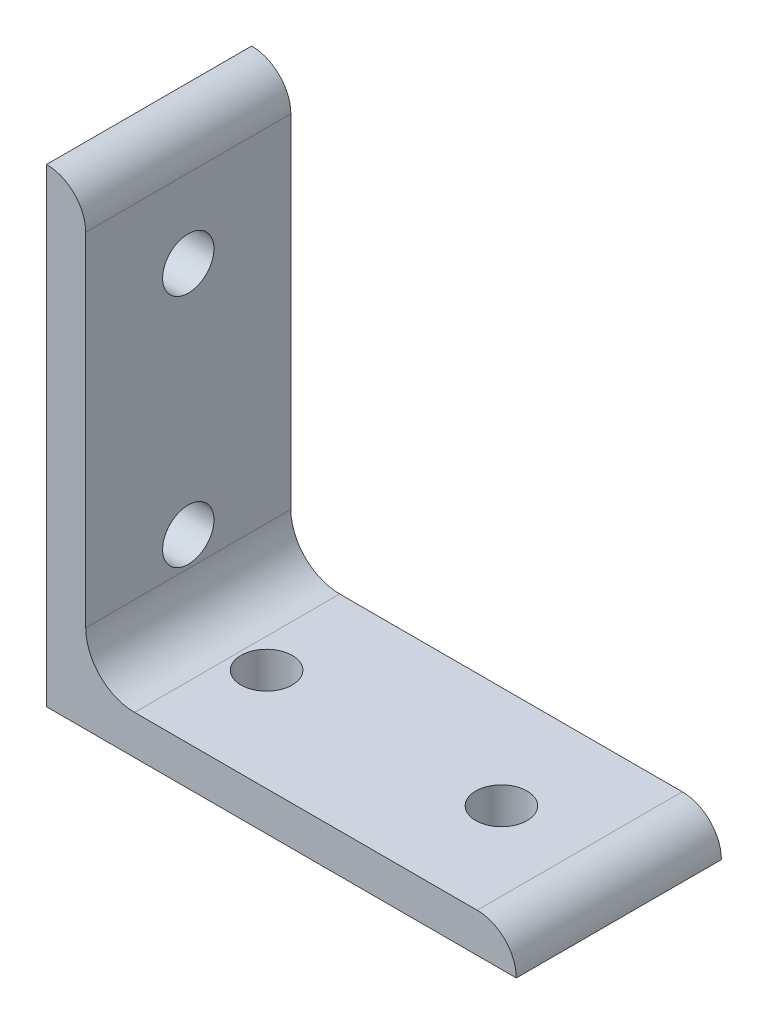
ISO-10303-21;
HEADER;
FILE_DESCRIPTION(('STEP AP214'),'2;1');
FILE_NAME('part.step','',(''),(''),'','','');
FILE_SCHEMA(('AUTOMOTIVE_DESIGN { 1 0 10303 214 1 1 1 1 }'));
ENDSEC;
DATA;
#1=APPLICATION_CONTEXT('core data for automotive mechanical design processes');
#2=APPLICATION_PROTOCOL_DEFINITION('international standard','automotive_design',2000,#1);
#3=PRODUCT_CONTEXT('',#1,'mechanical');
#4=PRODUCT('Part','Part','',(#3));
#5=PRODUCT_RELATED_PRODUCT_CATEGORY('part','',(#4));
#6=PRODUCT_DEFINITION_FORMATION('','',#4);
#7=PRODUCT_DEFINITION_CONTEXT('part definition',#1,'design');
#8=PRODUCT_DEFINITION('design','',#6,#7);
#9=PRODUCT_DEFINITION_SHAPE('','',#8);
#10=(LENGTH_UNIT() NAMED_UNIT(*) SI_UNIT(.MILLI.,.METRE.));
#11=(NAMED_UNIT(*) PLANE_ANGLE_UNIT() SI_UNIT($,.RADIAN.));
#12=(NAMED_UNIT(*) SI_UNIT($,.STERADIAN.) SOLID_ANGLE_UNIT());
#13=UNCERTAINTY_MEASURE_WITH_UNIT(LENGTH_MEASURE(1.E-05),#10,'distance_accuracy_value','');
#14=(GEOMETRIC_REPRESENTATION_CONTEXT(3) GLOBAL_UNCERTAINTY_ASSIGNED_CONTEXT((#13)) GLOBAL_UNIT_ASSIGNED_CONTEXT((#10,
#11,#12)) REPRESENTATION_CONTEXT('',''));
#15=CARTESIAN_POINT('',(0.,0.,0.));
#16=DIRECTION('',(0.,0.,1.));
#17=DIRECTION('',(1.,0.,0.));
#18=AXIS2_PLACEMENT_3D('',#15,#16,#17);
#19=CARTESIAN_POINT('',(6.35,69.85,16.637));
#20=DIRECTION('',(-1.,0.,0.));
#21=DIRECTION('',(0.,-1.,0.));
#22=AXIS2_PLACEMENT_3D('',#19,#20,#21);
#23=PLANE('',#22);
#24=DIRECTION('',(0.,1.,0.));
#25=VECTOR('',#24,1.);
#26=CARTESIAN_POINT('',(6.35,69.85,-16.637));
#27=LINE('',#26,#25);
#28=CARTESIAN_POINT('',(6.35,14.2748,-16.637));
#29=VERTEX_POINT('',#28);
#30=CARTESIAN_POINT('',(6.35,69.85,-16.637));
#31=VERTEX_POINT('',#30);
#32=EDGE_CURVE('E117',#29,#31,#27,.T.);
#33=ORIENTED_EDGE('',*,*,#32,.T.);
#34=DIRECTION('',(0.,0.,-1.));
#35=VECTOR('',#34,1.);
#36=CARTESIAN_POINT('',(6.35,69.85,16.637));
#37=LINE('',#36,#35);
#38=CARTESIAN_POINT('',(6.35,69.85,16.637));
#39=VERTEX_POINT('',#38);
#40=EDGE_CURVE('E114',#39,#31,#37,.T.);
#41=ORIENTED_EDGE('',*,*,#40,.F.);
#42=DIRECTION('',(0.,1.,0.));
#43=VECTOR('',#42,1.);
#44=CARTESIAN_POINT('',(6.35,69.85,16.637));
#45=LINE('',#44,#43);
#46=CARTESIAN_POINT('',(6.35,14.2748,16.637));
#47=VERTEX_POINT('',#46);
#48=EDGE_CURVE('E103',#47,#39,#45,.T.);
#49=ORIENTED_EDGE('',*,*,#48,.F.);
#50=DIRECTION('',(0.,0.,-1.));
#51=VECTOR('',#50,1.);
#52=CARTESIAN_POINT('',(6.35,14.2748,16.637));
#53=LINE('',#52,#51);
#54=EDGE_CURVE('E118',#47,#29,#53,.T.);
#55=ORIENTED_EDGE('',*,*,#54,.T.);
#56=EDGE_LOOP('',(#33,#41,#49,#55));
#57=FACE_BOUND('',#56,.T.);
#58=CARTESIAN_POINT('',(6.34999999999999,19.05,0.));
#59=DIRECTION('',(-1.,0.,0.));
#60=DIRECTION('',(0.,-1.,0.));
#61=AXIS2_PLACEMENT_3D('',#58,#59,#60);
#62=CIRCLE('',#61,4.1656);
#63=CARTESIAN_POINT('',(6.35,14.8844,0.));
#64=VERTEX_POINT('',#63);
#65=EDGE_CURVE('E196',#64,#64,#62,.F.);
#66=ORIENTED_EDGE('',*,*,#65,.F.);
#67=EDGE_LOOP('',(#66));
#68=FACE_BOUND('',#67,.T.);
#69=CARTESIAN_POINT('',(6.34999999999999,57.15,0.));
#70=DIRECTION('',(-1.,0.,0.));
#71=DIRECTION('',(0.,-1.,0.));
#72=AXIS2_PLACEMENT_3D('',#69,#70,#71);
#73=CIRCLE('',#72,4.1656);
#74=CARTESIAN_POINT('',(6.35,52.9844,0.));
#75=VERTEX_POINT('',#74);
#76=EDGE_CURVE('E191',#75,#75,#73,.F.);
#77=ORIENTED_EDGE('',*,*,#76,.F.);
#78=EDGE_LOOP('',(#77));
#79=FACE_BOUND('',#78,.T.);
#80=ADVANCED_FACE('F34',(#57,#68,#79),#23,.F.);
#81=CARTESIAN_POINT('',(0.,0.,16.637));
#82=DIRECTION('',(1.,0.,0.));
#83=DIRECTION('',(0.,0.,-1.));
#84=AXIS2_PLACEMENT_3D('',#81,#82,#83);
#85=PLANE('',#84);
#86=DIRECTION('',(0.,-1.,0.));
#87=VECTOR('',#86,1.);
#88=CARTESIAN_POINT('',(0.,0.,-16.637));
#89=LINE('',#88,#87);
#90=CARTESIAN_POINT('',(0.,76.2,-16.637));
#91=VERTEX_POINT('',#90);
#92=CARTESIAN_POINT('',(0.,0.,-16.637));
#93=VERTEX_POINT('',#92);
#94=EDGE_CURVE('E85',#91,#93,#89,.T.);
#95=ORIENTED_EDGE('',*,*,#94,.T.);
#96=DIRECTION('',(0.,0.,-1.));
#97=VECTOR('',#96,1.);
#98=CARTESIAN_POINT('',(0.,0.,16.637));
#99=LINE('',#98,#97);
#100=CARTESIAN_POINT('',(0.,0.,16.637));
#101=VERTEX_POINT('',#100);
#102=EDGE_CURVE('E123',#101,#93,#99,.T.);
#103=ORIENTED_EDGE('',*,*,#102,.F.);
#104=DIRECTION('',(0.,-1.,0.));
#105=VECTOR('',#104,1.);
#106=CARTESIAN_POINT('',(0.,0.,16.637));
#107=LINE('',#106,#105);
#108=CARTESIAN_POINT('',(0.,76.2,16.637));
#109=VERTEX_POINT('',#108);
#110=EDGE_CURVE('E53',#109,#101,#107,.T.);
#111=ORIENTED_EDGE('',*,*,#110,.F.);
#112=DIRECTION('',(0.,0.,-1.));
#113=VECTOR('',#112,1.);
#114=CARTESIAN_POINT('',(0.,76.2,16.637));
#115=LINE('',#114,#113);
#116=EDGE_CURVE('E119',#109,#91,#115,.T.);
#117=ORIENTED_EDGE('',*,*,#116,.T.);
#118=EDGE_LOOP('',(#95,#103,#111,#117));
#119=FACE_BOUND('',#118,.T.);
#120=CARTESIAN_POINT('',(0.,19.05,0.));
#121=DIRECTION('',(1.,0.,0.));
#122=DIRECTION('',(0.,0.,-1.));
#123=AXIS2_PLACEMENT_3D('',#120,#121,#122);
#124=CIRCLE('',#123,4.1656);
#125=CARTESIAN_POINT('',(0.,19.05,-4.1656));
#126=VERTEX_POINT('',#125);
#127=EDGE_CURVE('E186',#126,#126,#124,.T.);
#128=ORIENTED_EDGE('',*,*,#127,.T.);
#129=EDGE_LOOP('',(#128));
#130=FACE_BOUND('',#129,.T.);
#131=CARTESIAN_POINT('',(0.,57.15,0.));
#132=DIRECTION('',(1.,0.,0.));
#133=DIRECTION('',(0.,0.,-1.));
#134=AXIS2_PLACEMENT_3D('',#131,#132,#133);
#135=CIRCLE('',#134,4.1656);
#136=CARTESIAN_POINT('',(0.,57.15,-4.1656));
#137=VERTEX_POINT('',#136);
#138=EDGE_CURVE('E189',#137,#137,#135,.T.);
#139=ORIENTED_EDGE('',*,*,#138,.T.);
#140=EDGE_LOOP('',(#139));
#141=FACE_BOUND('',#140,.T.);
#142=ADVANCED_FACE('F179',(#119,#130,#141),#85,.F.);
#143=CARTESIAN_POINT('',(76.2,0.,16.637));
#144=DIRECTION('',(0.,1.,0.));
#145=DIRECTION('',(-1.,0.,0.));
#146=AXIS2_PLACEMENT_3D('',#143,#144,#145);
#147=PLANE('',#146);
#148=DIRECTION('',(1.,0.,0.));
#149=VECTOR('',#148,1.);
#150=CARTESIAN_POINT('',(76.2,0.,-16.637));
#151=LINE('',#150,#149);
#152=CARTESIAN_POINT('',(76.2,0.,-16.637));
#153=VERTEX_POINT('',#152);
#154=EDGE_CURVE('E127',#93,#153,#151,.T.);
#155=ORIENTED_EDGE('',*,*,#154,.T.);
#156=DIRECTION('',(0.,0.,-1.));
#157=VECTOR('',#156,1.);
#158=CARTESIAN_POINT('',(76.2,0.,16.637));
#159=LINE('',#158,#157);
#160=CARTESIAN_POINT('',(76.2,0.,16.637));
#161=VERTEX_POINT('',#160);
#162=EDGE_CURVE('E11',#161,#153,#159,.T.);
#163=ORIENTED_EDGE('',*,*,#162,.F.);
#164=DIRECTION('',(1.,0.,0.));
#165=VECTOR('',#164,1.);
#166=CARTESIAN_POINT('',(76.2,0.,16.637));
#167=LINE('',#166,#165);
#168=EDGE_CURVE('E140',#101,#161,#167,.T.);
#169=ORIENTED_EDGE('',*,*,#168,.F.);
#170=ORIENTED_EDGE('',*,*,#102,.T.);
#171=EDGE_LOOP('',(#155,#163,#169,#170));
#172=FACE_BOUND('',#171,.T.);
#173=CARTESIAN_POINT('',(19.05,0.,0.));
#174=DIRECTION('',(0.,1.,0.));
#175=DIRECTION('',(0.,0.,1.));
#176=AXIS2_PLACEMENT_3D('',#173,#174,#175);
#177=CIRCLE('',#176,4.1656);
#178=CARTESIAN_POINT('',(19.05,0.,4.1656));
#179=VERTEX_POINT('',#178);
#180=EDGE_CURVE('E149',#179,#179,#177,.T.);
#181=ORIENTED_EDGE('',*,*,#180,.T.);
#182=EDGE_LOOP('',(#181));
#183=FACE_BOUND('',#182,.T.);
#184=CARTESIAN_POINT('',(57.15,0.,0.));
#185=DIRECTION('',(0.,1.,0.));
#186=DIRECTION('',(0.,0.,1.));
#187=AXIS2_PLACEMENT_3D('',#184,#185,#186);
#188=CIRCLE('',#187,4.1656);
#189=CARTESIAN_POINT('',(57.15,0.,4.1656));
#190=VERTEX_POINT('',#189);
#191=EDGE_CURVE('E157',#190,#190,#188,.T.);
#192=ORIENTED_EDGE('',*,*,#191,.T.);
#193=EDGE_LOOP('',(#192));
#194=FACE_BOUND('',#193,.T.);
#195=ADVANCED_FACE('F36',(#172,#183,#194),#147,.F.);
#196=CARTESIAN_POINT('',(14.2748,6.35,16.637));
#197=DIRECTION('',(0.,-1.,0.));
#198=DIRECTION('',(1.,0.,0.));
#199=AXIS2_PLACEMENT_3D('',#196,#197,#198);
#200=PLANE('',#199);
#201=DIRECTION('',(-1.,0.,0.));
#202=VECTOR('',#201,1.);
#203=CARTESIAN_POINT('',(14.2748,6.35,-16.637));
#204=LINE('',#203,#202);
#205=CARTESIAN_POINT('',(69.85,6.35,-16.637));
#206=VERTEX_POINT('',#205);
#207=CARTESIAN_POINT('',(14.2748,6.35,-16.637));
#208=VERTEX_POINT('',#207);
#209=EDGE_CURVE('E133',#206,#208,#204,.T.);
#210=ORIENTED_EDGE('',*,*,#209,.T.);
#211=DIRECTION('',(0.,0.,-1.));
#212=VECTOR('',#211,1.);
#213=CARTESIAN_POINT('',(14.2748,6.35,16.637));
#214=LINE('',#213,#212);
#215=CARTESIAN_POINT('',(14.2748,6.35,16.637));
#216=VERTEX_POINT('',#215);
#217=EDGE_CURVE('E144',#216,#208,#214,.T.);
#218=ORIENTED_EDGE('',*,*,#217,.F.);
#219=DIRECTION('',(-1.,0.,0.));
#220=VECTOR('',#219,1.);
#221=CARTESIAN_POINT('',(14.2748,6.35,16.637));
#222=LINE('',#221,#220);
#223=CARTESIAN_POINT('',(69.85,6.35,16.637));
#224=VERTEX_POINT('',#223);
#225=EDGE_CURVE('E163',#224,#216,#222,.T.);
#226=ORIENTED_EDGE('',*,*,#225,.F.);
#227=DIRECTION('',(0.,0.,-1.));
#228=VECTOR('',#227,1.);
#229=CARTESIAN_POINT('',(69.85,6.35,16.637));
#230=LINE('',#229,#228);
#231=EDGE_CURVE('E44',#224,#206,#230,.T.);
#232=ORIENTED_EDGE('',*,*,#231,.T.);
#233=EDGE_LOOP('',(#210,#218,#226,#232));
#234=FACE_BOUND('',#233,.T.);
#235=CARTESIAN_POINT('',(19.05,6.35000000000001,0.));
#236=DIRECTION('',(0.,-1.,0.));
#237=DIRECTION('',(1.,0.,0.));
#238=AXIS2_PLACEMENT_3D('',#235,#236,#237);
#239=CIRCLE('',#238,4.1656);
#240=CARTESIAN_POINT('',(23.2156,6.35000000000001,0.));
#241=VERTEX_POINT('',#240);
#242=EDGE_CURVE('E131',#241,#241,#239,.F.);
#243=ORIENTED_EDGE('',*,*,#242,.F.);
#244=EDGE_LOOP('',(#243));
#245=FACE_BOUND('',#244,.T.);
#246=CARTESIAN_POINT('',(57.15,6.35000000000001,0.));
#247=DIRECTION('',(0.,-1.,0.));
#248=DIRECTION('',(1.,0.,0.));
#249=AXIS2_PLACEMENT_3D('',#246,#247,#248);
#250=CIRCLE('',#249,4.1656);
#251=CARTESIAN_POINT('',(61.3156,6.35000000000001,0.));
#252=VERTEX_POINT('',#251);
#253=EDGE_CURVE('E38',#252,#252,#250,.F.);
#254=ORIENTED_EDGE('',*,*,#253,.F.);
#255=EDGE_LOOP('',(#254));
#256=FACE_BOUND('',#255,.T.);
#257=ADVANCED_FACE('F167',(#234,#245,#256),#200,.F.);
#258=CARTESIAN_POINT('',(69.85,0.,16.637));
#259=DIRECTION('',(0.,0.,-1.));
#260=DIRECTION('',(-1.,0.,0.));
#261=AXIS2_PLACEMENT_3D('',#258,#259,#260);
#262=CYLINDRICAL_SURFACE('',#261,6.35000000000001);
#263=CARTESIAN_POINT('',(69.85,0.,-16.637));
#264=DIRECTION('',(0.,0.,1.));
#265=DIRECTION('',(1.,0.,0.));
#266=AXIS2_PLACEMENT_3D('',#263,#264,#265);
#267=CIRCLE('',#266,6.35000000000001);
#268=EDGE_CURVE('E130',#153,#206,#267,.T.);
#269=ORIENTED_EDGE('',*,*,#268,.T.);
#270=ORIENTED_EDGE('',*,*,#231,.F.);
#271=CARTESIAN_POINT('',(69.85,0.,16.637));
#272=DIRECTION('',(0.,0.,1.));
#273=DIRECTION('',(1.,0.,0.));
#274=AXIS2_PLACEMENT_3D('',#271,#272,#273);
#275=CIRCLE('',#274,6.35000000000001);
#276=EDGE_CURVE('E93',#161,#224,#275,.T.);
#277=ORIENTED_EDGE('',*,*,#276,.F.);
#278=ORIENTED_EDGE('',*,*,#162,.T.);
#279=EDGE_LOOP('',(#269,#270,#277,#278));
#280=FACE_BOUND('',#279,.T.);
#281=ADVANCED_FACE('F213',(#280),#262,.T.);
#282=CARTESIAN_POINT('',(14.2748,14.2748,16.637));
#283=DIRECTION('',(0.,0.,-1.));
#284=DIRECTION('',(-1.,0.,0.));
#285=AXIS2_PLACEMENT_3D('',#282,#283,#284);
#286=CYLINDRICAL_SURFACE('',#285,7.9248);
#287=CARTESIAN_POINT('',(14.2748,14.2748,-16.637));
#288=DIRECTION('',(0.,0.,-1.));
#289=DIRECTION('',(1.,0.,0.));
#290=AXIS2_PLACEMENT_3D('',#287,#288,#289);
#291=CIRCLE('',#290,7.9248);
#292=EDGE_CURVE('E135',#208,#29,#291,.T.);
#293=ORIENTED_EDGE('',*,*,#292,.T.);
#294=ORIENTED_EDGE('',*,*,#54,.F.);
#295=CARTESIAN_POINT('',(14.2748,14.2748,16.637));
#296=DIRECTION('',(0.,0.,-1.));
#297=DIRECTION('',(1.,0.,0.));
#298=AXIS2_PLACEMENT_3D('',#295,#296,#297);
#299=CIRCLE('',#298,7.9248);
#300=EDGE_CURVE('E109',#216,#47,#299,.T.);
#301=ORIENTED_EDGE('',*,*,#300,.F.);
#302=ORIENTED_EDGE('',*,*,#217,.T.);
#303=EDGE_LOOP('',(#293,#294,#301,#302));
#304=FACE_BOUND('',#303,.T.);
#305=ADVANCED_FACE('F172',(#304),#286,.F.);
#306=CARTESIAN_POINT('',(0.,69.85,16.637));
#307=DIRECTION('',(0.,0.,-1.));
#308=DIRECTION('',(-1.,0.,0.));
#309=AXIS2_PLACEMENT_3D('',#306,#307,#308);
#310=CYLINDRICAL_SURFACE('',#309,6.35000000000001);
#311=CARTESIAN_POINT('',(0.,69.85,-16.637));
#312=DIRECTION('',(0.,0.,1.));
#313=DIRECTION('',(1.,0.,0.));
#314=AXIS2_PLACEMENT_3D('',#311,#312,#313);
#315=CIRCLE('',#314,6.35000000000001);
#316=EDGE_CURVE('E79',#31,#91,#315,.T.);
#317=ORIENTED_EDGE('',*,*,#316,.T.);
#318=ORIENTED_EDGE('',*,*,#116,.F.);
#319=CARTESIAN_POINT('',(0.,69.85,16.637));
#320=DIRECTION('',(0.,0.,1.));
#321=DIRECTION('',(1.,0.,0.));
#322=AXIS2_PLACEMENT_3D('',#319,#320,#321);
#323=CIRCLE('',#322,6.35000000000001);
#324=EDGE_CURVE('E107',#39,#109,#323,.T.);
#325=ORIENTED_EDGE('',*,*,#324,.F.);
#326=ORIENTED_EDGE('',*,*,#40,.T.);
#327=EDGE_LOOP('',(#317,#318,#325,#326));
#328=FACE_BOUND('',#327,.T.);
#329=ADVANCED_FACE('F121',(#328),#310,.T.);
#330=CARTESIAN_POINT('',(0.,69.85,16.637));
#331=DIRECTION('',(0.,0.,1.));
#332=DIRECTION('',(1.,0.,0.));
#333=AXIS2_PLACEMENT_3D('',#330,#331,#332);
#334=PLANE('',#333);
#335=ORIENTED_EDGE('',*,*,#168,.T.);
#336=ORIENTED_EDGE('',*,*,#276,.T.);
#337=ORIENTED_EDGE('',*,*,#225,.T.);
#338=ORIENTED_EDGE('',*,*,#300,.T.);
#339=ORIENTED_EDGE('',*,*,#48,.T.);
#340=ORIENTED_EDGE('',*,*,#324,.T.);
#341=ORIENTED_EDGE('',*,*,#110,.T.);
#342=EDGE_LOOP('',(#335,#336,#337,#338,#339,#340,#341));
#343=FACE_BOUND('',#342,.T.);
#344=ADVANCED_FACE('F105',(#343),#334,.T.);
#345=CARTESIAN_POINT('',(0.,69.85,-16.637));
#346=DIRECTION('',(0.,0.,1.));
#347=DIRECTION('',(1.,0.,0.));
#348=AXIS2_PLACEMENT_3D('',#345,#346,#347);
#349=PLANE('',#348);
#350=ORIENTED_EDGE('',*,*,#154,.F.);
#351=ORIENTED_EDGE('',*,*,#94,.F.);
#352=ORIENTED_EDGE('',*,*,#316,.F.);
#353=ORIENTED_EDGE('',*,*,#32,.F.);
#354=ORIENTED_EDGE('',*,*,#292,.F.);
#355=ORIENTED_EDGE('',*,*,#209,.F.);
#356=ORIENTED_EDGE('',*,*,#268,.F.);
#357=EDGE_LOOP('',(#350,#351,#352,#353,#354,#355,#356));
#358=FACE_BOUND('',#357,.T.);
#359=ADVANCED_FACE('F175',(#358),#349,.F.);
#360=CARTESIAN_POINT('',(19.05,76.2,0.));
#361=DIRECTION('',(0.,-1.,0.));
#362=DIRECTION('',(0.,0.,-1.));
#363=AXIS2_PLACEMENT_3D('',#360,#361,#362);
#364=CYLINDRICAL_SURFACE('',#363,4.1656);
#365=ORIENTED_EDGE('',*,*,#180,.F.);
#366=EDGE_LOOP('',(#365));
#367=FACE_BOUND('',#366,.T.);
#368=ORIENTED_EDGE('',*,*,#242,.T.);
#369=EDGE_LOOP('',(#368));
#370=FACE_BOUND('',#369,.T.);
#371=ADVANCED_FACE('F208',(#367,#370),#364,.F.);
#372=CARTESIAN_POINT('',(57.15,76.2,0.));
#373=DIRECTION('',(0.,-1.,0.));
#374=DIRECTION('',(0.,0.,-1.));
#375=AXIS2_PLACEMENT_3D('',#372,#373,#374);
#376=CYLINDRICAL_SURFACE('',#375,4.1656);
#377=ORIENTED_EDGE('',*,*,#191,.F.);
#378=EDGE_LOOP('',(#377));
#379=FACE_BOUND('',#378,.T.);
#380=ORIENTED_EDGE('',*,*,#253,.T.);
#381=EDGE_LOOP('',(#380));
#382=FACE_BOUND('',#381,.T.);
#383=ADVANCED_FACE('F204',(#379,#382),#376,.F.);
#384=CARTESIAN_POINT('',(76.2,19.05,0.));
#385=DIRECTION('',(-1.,0.,0.));
#386=DIRECTION('',(0.,0.,1.));
#387=AXIS2_PLACEMENT_3D('',#384,#385,#386);
#388=CYLINDRICAL_SURFACE('',#387,4.1656);
#389=ORIENTED_EDGE('',*,*,#127,.F.);
#390=EDGE_LOOP('',(#389));
#391=FACE_BOUND('',#390,.T.);
#392=ORIENTED_EDGE('',*,*,#65,.T.);
#393=EDGE_LOOP('',(#392));
#394=FACE_BOUND('',#393,.T.);
#395=ADVANCED_FACE('F207',(#391,#394),#388,.F.);
#396=CARTESIAN_POINT('',(76.2,57.15,0.));
#397=DIRECTION('',(-1.,0.,0.));
#398=DIRECTION('',(0.,0.,1.));
#399=AXIS2_PLACEMENT_3D('',#396,#397,#398);
#400=CYLINDRICAL_SURFACE('',#399,4.1656);
#401=ORIENTED_EDGE('',*,*,#138,.F.);
#402=EDGE_LOOP('',(#401));
#403=FACE_BOUND('',#402,.T.);
#404=ORIENTED_EDGE('',*,*,#76,.T.);
#405=EDGE_LOOP('',(#404));
#406=FACE_BOUND('',#405,.T.);
#407=ADVANCED_FACE('F243',(#403,#406),#400,.F.);
#408=CLOSED_SHELL('',(#80,#142,#195,#257,#281,#305,#329,#344,#359,#371,#383,#395,#407));
#409=MANIFOLD_SOLID_BREP('B2',#408);
#410=ADVANCED_BREP_SHAPE_REPRESENTATION('',(#18,#409),#14);
#411=SHAPE_DEFINITION_REPRESENTATION(#9,#410);
ENDSEC;
END-ISO-10303-21;
